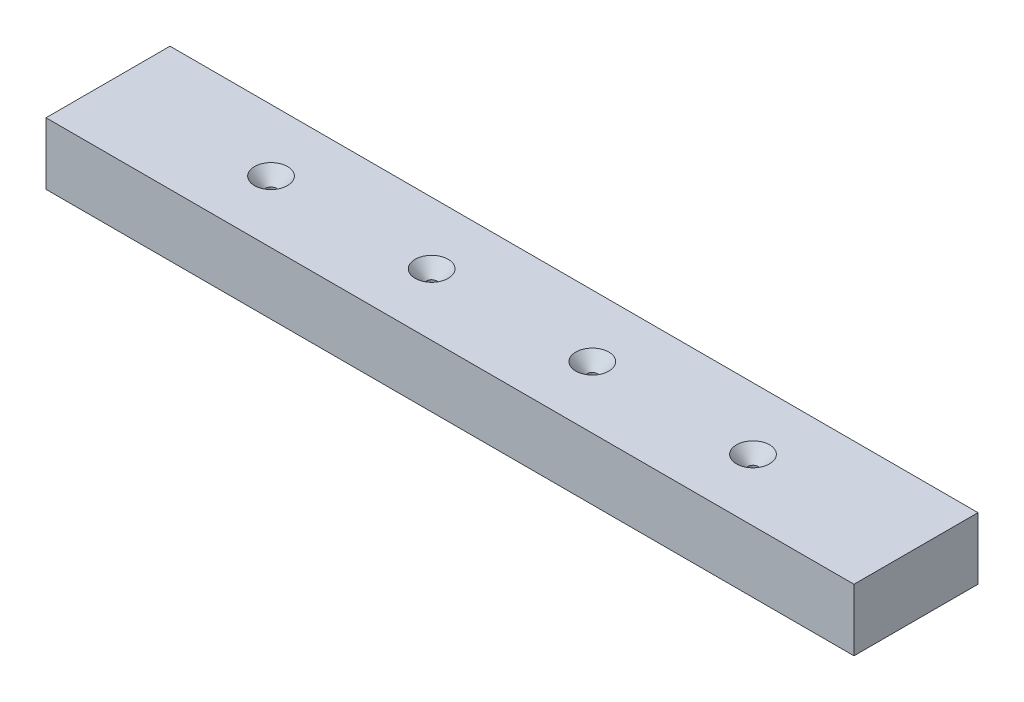
ISO-10303-21;
HEADER;
FILE_DESCRIPTION(('STEP AP214'),'2;1');
FILE_NAME('part.step','',(''),(''),'','','');
FILE_SCHEMA(('AUTOMOTIVE_DESIGN { 1 0 10303 214 1 1 1 1 }'));
ENDSEC;
DATA;
#1=APPLICATION_CONTEXT('core data for automotive mechanical design processes');
#2=APPLICATION_PROTOCOL_DEFINITION('international standard','automotive_design',2000,#1);
#3=PRODUCT_CONTEXT('',#1,'mechanical');
#4=PRODUCT('Part','Part','',(#3));
#5=PRODUCT_RELATED_PRODUCT_CATEGORY('part','',(#4));
#6=PRODUCT_DEFINITION_FORMATION('','',#4);
#7=PRODUCT_DEFINITION_CONTEXT('part definition',#1,'design');
#8=PRODUCT_DEFINITION('design','',#6,#7);
#9=PRODUCT_DEFINITION_SHAPE('','',#8);
#10=(LENGTH_UNIT() NAMED_UNIT(*) SI_UNIT(.MILLI.,.METRE.));
#11=(NAMED_UNIT(*) PLANE_ANGLE_UNIT() SI_UNIT($,.RADIAN.));
#12=(NAMED_UNIT(*) SI_UNIT($,.STERADIAN.) SOLID_ANGLE_UNIT());
#13=UNCERTAINTY_MEASURE_WITH_UNIT(LENGTH_MEASURE(1.E-05),#10,'distance_accuracy_value','');
#14=(GEOMETRIC_REPRESENTATION_CONTEXT(3) GLOBAL_UNCERTAINTY_ASSIGNED_CONTEXT((#13)) GLOBAL_UNIT_ASSIGNED_CONTEXT((#10,
#11,#12)) REPRESENTATION_CONTEXT('',''));
#15=CARTESIAN_POINT('',(0.,0.,0.));
#16=DIRECTION('',(0.,0.,1.));
#17=DIRECTION('',(1.,0.,0.));
#18=AXIS2_PLACEMENT_3D('',#15,#16,#17);
#19=CARTESIAN_POINT('',(248.249999999993,38.1000000000005,38.0999999999995));
#20=DIRECTION('',(-1.,0.,0.));
#21=DIRECTION('',(0.,-1.,0.));
#22=AXIS2_PLACEMENT_3D('',#19,#20,#21);
#23=PLANE('',#22);
#24=DIRECTION('',(0.,1.,0.));
#25=VECTOR('',#24,1.);
#26=CARTESIAN_POINT('',(248.249999999993,38.1000000000005,-2.22044604925031E-13));
#27=LINE('',#26,#25);
#28=CARTESIAN_POINT('',(248.249999999993,38.1000000000005,-2.22044604925031E-13));
#29=VERTEX_POINT('',#28);
#30=CARTESIAN_POINT('',(248.249999999993,57.1500000000001,-2.77555756156289E-13));
#31=VERTEX_POINT('',#30);
#32=EDGE_CURVE('E130',#29,#31,#27,.T.);
#33=ORIENTED_EDGE('',*,*,#32,.T.);
#34=DIRECTION('',(0.,0.,-0.999999999999999));
#35=VECTOR('',#34,1.);
#36=CARTESIAN_POINT('',(248.249999999993,57.15,38.0999999999989));
#37=LINE('',#36,#35);
#38=CARTESIAN_POINT('',(248.249999999993,57.15,38.0999999999989));
#39=VERTEX_POINT('',#38);
#40=EDGE_CURVE('E11',#39,#31,#37,.T.);
#41=ORIENTED_EDGE('',*,*,#40,.F.);
#42=DIRECTION('',(0.,1.,0.));
#43=VECTOR('',#42,1.);
#44=CARTESIAN_POINT('',(248.249999999993,38.1000000000005,38.0999999999995));
#45=LINE('',#44,#43);
#46=CARTESIAN_POINT('',(248.249999999993,38.1000000000005,38.0999999999995));
#47=VERTEX_POINT('',#46);
#48=EDGE_CURVE('E123',#47,#39,#45,.T.);
#49=ORIENTED_EDGE('',*,*,#48,.F.);
#50=DIRECTION('',(0.,0.,-0.999999999999999));
#51=VECTOR('',#50,1.);
#52=CARTESIAN_POINT('',(248.249999999993,38.1000000000005,38.0999999999995));
#53=LINE('',#52,#51);
#54=EDGE_CURVE('E129',#47,#29,#53,.T.);
#55=ORIENTED_EDGE('',*,*,#54,.T.);
#56=EDGE_LOOP('',(#33,#41,#49,#55));
#57=FACE_BOUND('',#56,.T.);
#58=ADVANCED_FACE('F35',(#57),#23,.F.);
#59=CARTESIAN_POINT('',(248.249999999993,57.15,38.0999999999989));
#60=DIRECTION('',(0.,-1.,0.));
#61=DIRECTION('',(1.,0.,0.));
#62=AXIS2_PLACEMENT_3D('',#59,#60,#61);
#63=PLANE('',#62);
#64=CARTESIAN_POINT('',(198.168749999995,57.1500000000041,19.0499999999458));
#65=DIRECTION('',(0.,1.,0.));
#66=DIRECTION('',(0.,0.,0.999999999999999));
#67=AXIS2_PLACEMENT_3D('',#64,#65,#66);
#68=CIRCLE('',#67,5.08);
#69=CARTESIAN_POINT('',(198.168749999995,57.1500000000041,24.1299999999458));
#70=VERTEX_POINT('',#69);
#71=EDGE_CURVE('E327',#70,#70,#68,.T.);
#72=ORIENTED_EDGE('',*,*,#71,.F.);
#73=EDGE_LOOP('',(#72));
#74=FACE_BOUND('',#73,.T.);
#75=CARTESIAN_POINT('',(148.806249999996,57.150000000004,19.0499999999588));
#76=DIRECTION('',(0.,1.,0.));
#77=DIRECTION('',(0.,0.,0.999999999999999));
#78=AXIS2_PLACEMENT_3D('',#75,#76,#77);
#79=CIRCLE('',#78,5.08);
#80=CARTESIAN_POINT('',(148.806249999996,57.150000000004,24.1299999999588));
#81=VERTEX_POINT('',#80);
#82=EDGE_CURVE('E158',#81,#81,#79,.T.);
#83=ORIENTED_EDGE('',*,*,#82,.F.);
#84=EDGE_LOOP('',(#83));
#85=FACE_BOUND('',#84,.T.);
#86=CARTESIAN_POINT('',(50.0812499999983,57.1500000000043,19.0499999999982));
#87=DIRECTION('',(0.,1.,0.));
#88=DIRECTION('',(0.,0.,0.999999999999999));
#89=AXIS2_PLACEMENT_3D('',#86,#87,#88);
#90=CIRCLE('',#89,5.08);
#91=CARTESIAN_POINT('',(50.0812499999983,57.1500000000043,24.1299999999982));
#92=VERTEX_POINT('',#91);
#93=EDGE_CURVE('E151',#92,#92,#90,.T.);
#94=ORIENTED_EDGE('',*,*,#93,.F.);
#95=EDGE_LOOP('',(#94));
#96=FACE_BOUND('',#95,.T.);
#97=CARTESIAN_POINT('',(99.4437499999972,57.1500000000041,19.0499999999765));
#98=DIRECTION('',(0.,1.,0.));
#99=DIRECTION('',(0.,0.,0.999999999999999));
#100=AXIS2_PLACEMENT_3D('',#97,#98,#99);
#101=CIRCLE('',#100,5.08);
#102=CARTESIAN_POINT('',(99.4437499999972,57.1500000000041,24.1299999999765));
#103=VERTEX_POINT('',#102);
#104=EDGE_CURVE('E147',#103,#103,#101,.T.);
#105=ORIENTED_EDGE('',*,*,#104,.F.);
#106=EDGE_LOOP('',(#105));
#107=FACE_BOUND('',#106,.T.);
#108=DIRECTION('',(-1.,0.,0.));
#109=VECTOR('',#108,1.);
#110=CARTESIAN_POINT('',(248.249999999993,57.1500000000001,-2.77555756156289E-13));
#111=LINE('',#110,#109);
#112=CARTESIAN_POINT('',(-2.88657986402541E-12,57.1500000000001,-4.44089209850063E-13));
#113=VERTEX_POINT('',#112);
#114=EDGE_CURVE('E133',#31,#113,#111,.T.);
#115=ORIENTED_EDGE('',*,*,#114,.T.);
#116=DIRECTION('',(0.,0.,-0.999999999999999));
#117=VECTOR('',#116,1.);
#118=CARTESIAN_POINT('',(-2.88657986402541E-12,57.1499999999998,38.0999999999989));
#119=LINE('',#118,#117);
#120=CARTESIAN_POINT('',(-2.88657986402541E-12,57.1499999999998,38.0999999999989));
#121=VERTEX_POINT('',#120);
#122=EDGE_CURVE('E44',#121,#113,#119,.T.);
#123=ORIENTED_EDGE('',*,*,#122,.F.);
#124=DIRECTION('',(-1.,0.,0.));
#125=VECTOR('',#124,1.);
#126=CARTESIAN_POINT('',(248.249999999993,57.15,38.0999999999989));
#127=LINE('',#126,#125);
#128=EDGE_CURVE('E84',#39,#121,#127,.T.);
#129=ORIENTED_EDGE('',*,*,#128,.F.);
#130=ORIENTED_EDGE('',*,*,#40,.T.);
#131=EDGE_LOOP('',(#115,#123,#129,#130));
#132=FACE_BOUND('',#131,.T.);
#133=ADVANCED_FACE('F188',(#74,#85,#96,#107,#132),#63,.F.);
#134=CARTESIAN_POINT('',(-2.66453525910038E-12,38.1000000000003,38.0999999999998));
#135=DIRECTION('',(1.,0.,0.));
#136=DIRECTION('',(0.,1.,0.));
#137=AXIS2_PLACEMENT_3D('',#134,#135,#136);
#138=PLANE('',#137);
#139=DIRECTION('',(0.,-1.,0.));
#140=VECTOR('',#139,1.);
#141=CARTESIAN_POINT('',(-2.66453525910038E-12,38.1000000000006,0.));
#142=LINE('',#141,#140);
#143=CARTESIAN_POINT('',(-2.66453525910038E-12,38.1000000000006,0.));
#144=VERTEX_POINT('',#143);
#145=EDGE_CURVE('E71',#113,#144,#142,.T.);
#146=ORIENTED_EDGE('',*,*,#145,.T.);
#147=DIRECTION('',(0.,0.,-0.999999999999999));
#148=VECTOR('',#147,1.);
#149=CARTESIAN_POINT('',(-2.66453525910038E-12,38.1000000000003,38.0999999999998));
#150=LINE('',#149,#148);
#151=CARTESIAN_POINT('',(-2.66453525910038E-12,38.1000000000003,38.0999999999998));
#152=VERTEX_POINT('',#151);
#153=EDGE_CURVE('E138',#152,#144,#150,.T.);
#154=ORIENTED_EDGE('',*,*,#153,.F.);
#155=DIRECTION('',(0.,-1.,0.));
#156=VECTOR('',#155,1.);
#157=CARTESIAN_POINT('',(-2.66453525910038E-12,38.1000000000003,38.0999999999998));
#158=LINE('',#157,#156);
#159=EDGE_CURVE('E126',#121,#152,#158,.T.);
#160=ORIENTED_EDGE('',*,*,#159,.F.);
#161=ORIENTED_EDGE('',*,*,#122,.T.);
#162=EDGE_LOOP('',(#146,#154,#160,#161));
#163=FACE_BOUND('',#162,.T.);
#164=ADVANCED_FACE('F193',(#163),#138,.F.);
#165=CARTESIAN_POINT('',(248.249999999993,38.1000000000005,38.0999999999995));
#166=DIRECTION('',(0.,1.,0.));
#167=DIRECTION('',(0.,0.,0.999999999999999));
#168=AXIS2_PLACEMENT_3D('',#165,#166,#167);
#169=PLANE('',#168);
#170=CARTESIAN_POINT('',(198.168749999995,38.1000000000006,19.0499999999458));
#171=DIRECTION('',(0.,1.,0.));
#172=DIRECTION('',(0.,0.,0.999999999999999));
#173=AXIS2_PLACEMENT_3D('',#170,#171,#172);
#174=CIRCLE('',#173,1.58749999999999);
#175=CARTESIAN_POINT('',(198.168749999995,38.1000000000006,20.6374999999458));
#176=VERTEX_POINT('',#175);
#177=EDGE_CURVE('E38',#176,#176,#174,.T.);
#178=ORIENTED_EDGE('',*,*,#177,.T.);
#179=EDGE_LOOP('',(#178));
#180=FACE_BOUND('',#179,.T.);
#181=CARTESIAN_POINT('',(148.806249999996,38.1000000000005,19.0499999999589));
#182=DIRECTION('',(0.,1.,0.));
#183=DIRECTION('',(0.,0.,0.999999999999999));
#184=AXIS2_PLACEMENT_3D('',#181,#182,#183);
#185=CIRCLE('',#184,1.58749999999999);
#186=CARTESIAN_POINT('',(148.806249999996,38.1000000000005,20.6374999999589));
#187=VERTEX_POINT('',#186);
#188=EDGE_CURVE('E149',#187,#187,#185,.T.);
#189=ORIENTED_EDGE('',*,*,#188,.T.);
#190=EDGE_LOOP('',(#189));
#191=FACE_BOUND('',#190,.T.);
#192=CARTESIAN_POINT('',(50.0812499999983,38.1000000000007,19.0499999999986));
#193=DIRECTION('',(0.,1.,0.));
#194=DIRECTION('',(0.,0.,0.999999999999999));
#195=AXIS2_PLACEMENT_3D('',#192,#193,#194);
#196=CIRCLE('',#195,1.5875);
#197=CARTESIAN_POINT('',(50.0812499999983,38.1000000000007,20.6374999999986));
#198=VERTEX_POINT('',#197);
#199=EDGE_CURVE('E145',#198,#198,#196,.T.);
#200=ORIENTED_EDGE('',*,*,#199,.T.);
#201=EDGE_LOOP('',(#200));
#202=FACE_BOUND('',#201,.T.);
#203=CARTESIAN_POINT('',(99.4437499999969,38.1000000000005,19.0499999999766));
#204=DIRECTION('',(0.,1.,0.));
#205=DIRECTION('',(0.,0.,0.999999999999999));
#206=AXIS2_PLACEMENT_3D('',#203,#204,#205);
#207=CIRCLE('',#206,1.58750000000001);
#208=CARTESIAN_POINT('',(99.4437499999969,38.1000000000005,20.6374999999766));
#209=VERTEX_POINT('',#208);
#210=EDGE_CURVE('E105',#209,#209,#207,.T.);
#211=ORIENTED_EDGE('',*,*,#210,.T.);
#212=EDGE_LOOP('',(#211));
#213=FACE_BOUND('',#212,.T.);
#214=DIRECTION('',(1.,0.,0.));
#215=VECTOR('',#214,1.);
#216=CARTESIAN_POINT('',(248.249999999993,38.1000000000005,-2.22044604925031E-13));
#217=LINE('',#216,#215);
#218=EDGE_CURVE('E77',#144,#29,#217,.T.);
#219=ORIENTED_EDGE('',*,*,#218,.T.);
#220=ORIENTED_EDGE('',*,*,#54,.F.);
#221=DIRECTION('',(1.,0.,0.));
#222=VECTOR('',#221,1.);
#223=CARTESIAN_POINT('',(248.249999999993,38.1000000000005,38.0999999999995));
#224=LINE('',#223,#222);
#225=EDGE_CURVE('E53',#152,#47,#224,.T.);
#226=ORIENTED_EDGE('',*,*,#225,.F.);
#227=ORIENTED_EDGE('',*,*,#153,.T.);
#228=EDGE_LOOP('',(#219,#220,#226,#227));
#229=FACE_BOUND('',#228,.T.);
#230=ADVANCED_FACE('F203',(#180,#191,#202,#213,#229),#169,.F.);
#231=CARTESIAN_POINT('',(-2.22044604925031E-13,0.,38.0999999999993));
#232=DIRECTION('',(0.,0.,0.999999999999999));
#233=DIRECTION('',(1.,0.,0.));
#234=AXIS2_PLACEMENT_3D('',#231,#232,#233);
#235=PLANE('',#234);
#236=ORIENTED_EDGE('',*,*,#48,.T.);
#237=ORIENTED_EDGE('',*,*,#128,.T.);
#238=ORIENTED_EDGE('',*,*,#159,.T.);
#239=ORIENTED_EDGE('',*,*,#225,.T.);
#240=EDGE_LOOP('',(#236,#237,#238,#239));
#241=FACE_BOUND('',#240,.T.);
#242=ADVANCED_FACE('F201',(#241),#235,.T.);
#243=CARTESIAN_POINT('',(0.,0.,0.));
#244=DIRECTION('',(0.,0.,0.999999999999999));
#245=DIRECTION('',(1.,0.,0.));
#246=AXIS2_PLACEMENT_3D('',#243,#244,#245);
#247=PLANE('',#246);
#248=CARTESIAN_POINT('',(222.849999999992,47.6249999999993,0.));
#249=DIRECTION('',(0.,0.,0.999999999999999));
#250=DIRECTION('',(1.,0.,0.));
#251=AXIS2_PLACEMENT_3D('',#248,#249,#250);
#252=CIRCLE('',#251,1.58749999999999);
#253=CARTESIAN_POINT('',(224.437499999992,47.6249999999993,0.));
#254=VERTEX_POINT('',#253);
#255=EDGE_CURVE('E104',#254,#254,#252,.T.);
#256=ORIENTED_EDGE('',*,*,#255,.T.);
#257=EDGE_LOOP('',(#256));
#258=FACE_BOUND('',#257,.T.);
#259=CARTESIAN_POINT('',(25.3999999999957,47.6249999999994,-2.22044604925031E-13));
#260=DIRECTION('',(0.,0.,0.999999999999999));
#261=DIRECTION('',(1.,0.,0.));
#262=AXIS2_PLACEMENT_3D('',#259,#260,#261);
#263=CIRCLE('',#262,1.5875);
#264=CARTESIAN_POINT('',(26.9874999999956,47.6249999999994,-2.22132728877611E-13));
#265=VERTEX_POINT('',#264);
#266=EDGE_CURVE('E118',#265,#265,#263,.T.);
#267=ORIENTED_EDGE('',*,*,#266,.T.);
#268=EDGE_LOOP('',(#267));
#269=FACE_BOUND('',#268,.T.);
#270=CARTESIAN_POINT('',(124.124999999994,47.6249999999993,-6.10622663543836E-13));
#271=DIRECTION('',(0.,0.,0.999999999999999));
#272=DIRECTION('',(1.,0.,0.));
#273=AXIS2_PLACEMENT_3D('',#270,#271,#272);
#274=CIRCLE('',#273,1.58749999999999);
#275=CARTESIAN_POINT('',(125.712499999994,47.6249999999993,-6.10710787496416E-13));
#276=VERTEX_POINT('',#275);
#277=EDGE_CURVE('E122',#276,#276,#274,.T.);
#278=ORIENTED_EDGE('',*,*,#277,.T.);
#279=EDGE_LOOP('',(#278));
#280=FACE_BOUND('',#279,.T.);
#281=ORIENTED_EDGE('',*,*,#32,.F.);
#282=ORIENTED_EDGE('',*,*,#218,.F.);
#283=ORIENTED_EDGE('',*,*,#145,.F.);
#284=ORIENTED_EDGE('',*,*,#114,.F.);
#285=EDGE_LOOP('',(#281,#282,#283,#284));
#286=FACE_BOUND('',#285,.T.);
#287=ADVANCED_FACE('F199',(#258,#269,#280,#286),#247,.F.);
#288=CARTESIAN_POINT('',(124.124999999994,47.6249999999994,-12.6999999999973));
#289=DIRECTION('',(0.,0.,-0.999999999999999));
#290=DIRECTION('',(0.,1.,0.));
#291=AXIS2_PLACEMENT_3D('',#288,#289,#290);
#292=CYLINDRICAL_SURFACE('',#291,1.58749999999999);
#293=CARTESIAN_POINT('',(124.124999999994,47.6249999999993,19.0500000000028));
#294=DIRECTION('',(0.,0.,-0.999999999999999));
#295=DIRECTION('',(0.,1.,0.));
#296=AXIS2_PLACEMENT_3D('',#293,#294,#295);
#297=CIRCLE('',#296,1.58749999999999);
#298=CARTESIAN_POINT('',(124.124999999994,49.2124999999993,19.0500000000028));
#299=VERTEX_POINT('',#298);
#300=EDGE_CURVE('E119',#299,#299,#297,.T.);
#301=ORIENTED_EDGE('',*,*,#300,.F.);
#302=EDGE_LOOP('',(#301));
#303=FACE_BOUND('',#302,.T.);
#304=ORIENTED_EDGE('',*,*,#277,.F.);
#305=EDGE_LOOP('',(#304));
#306=FACE_BOUND('',#305,.T.);
#307=ADVANCED_FACE('F209',(#303,#306),#292,.F.);
#308=CARTESIAN_POINT('',(124.124999999994,47.6249999999993,19.0500000000028));
#309=DIRECTION('',(0.,0.,-0.999999999999999));
#310=DIRECTION('',(0.,1.,0.));
#311=AXIS2_PLACEMENT_3D('',#308,#309,#310);
#312=CONICAL_SURFACE('',#311,1.58749999999999,1.02974425867665);
#313=CARTESIAN_POINT('',(124.124999999994,47.6249999999993,20.0038662327096));
#314=VERTEX_POINT('',#313);
#315=VERTEX_LOOP('',#314);
#316=FACE_BOUND('',#315,.T.);
#317=ORIENTED_EDGE('',*,*,#300,.T.);
#318=EDGE_LOOP('',(#317));
#319=FACE_BOUND('',#318,.T.);
#320=ADVANCED_FACE('F215',(#316,#319),#312,.F.);
#321=CARTESIAN_POINT('',(25.3999999999961,47.6249999999993,-12.699999999998));
#322=DIRECTION('',(0.,0.,-0.999999999999999));
#323=DIRECTION('',(0.,1.,0.));
#324=AXIS2_PLACEMENT_3D('',#321,#322,#323);
#325=CYLINDRICAL_SURFACE('',#324,1.5875);
#326=CARTESIAN_POINT('',(25.3999999999957,47.6249999999993,19.0500000000029));
#327=DIRECTION('',(0.,0.,-0.999999999999999));
#328=DIRECTION('',(0.,1.,0.));
#329=AXIS2_PLACEMENT_3D('',#326,#327,#328);
#330=CIRCLE('',#329,1.5875);
#331=CARTESIAN_POINT('',(25.3999999999957,49.2124999999993,19.0500000000029));
#332=VERTEX_POINT('',#331);
#333=EDGE_CURVE('E108',#332,#332,#330,.T.);
#334=ORIENTED_EDGE('',*,*,#333,.F.);
#335=EDGE_LOOP('',(#334));
#336=FACE_BOUND('',#335,.T.);
#337=ORIENTED_EDGE('',*,*,#266,.F.);
#338=EDGE_LOOP('',(#337));
#339=FACE_BOUND('',#338,.T.);
#340=ADVANCED_FACE('F246',(#336,#339),#325,.F.);
#341=CARTESIAN_POINT('',(25.3999999999957,47.6249999999993,19.0500000000029));
#342=DIRECTION('',(0.,0.,-0.999999999999999));
#343=DIRECTION('',(0.,1.,0.));
#344=AXIS2_PLACEMENT_3D('',#341,#342,#343);
#345=CONICAL_SURFACE('',#344,1.5875,1.02974425867666);
#346=CARTESIAN_POINT('',(25.3999999999957,47.6249999999993,20.0038662327086));
#347=VERTEX_POINT('',#346);
#348=VERTEX_LOOP('',#347);
#349=FACE_BOUND('',#348,.T.);
#350=ORIENTED_EDGE('',*,*,#333,.T.);
#351=EDGE_LOOP('',(#350));
#352=FACE_BOUND('',#351,.T.);
#353=ADVANCED_FACE('F253',(#349,#352),#345,.F.);
#354=CARTESIAN_POINT('',(222.849999999992,47.6249999999996,-12.6999999999958));
#355=DIRECTION('',(0.,0.,-0.999999999999999));
#356=DIRECTION('',(0.,1.,0.));
#357=AXIS2_PLACEMENT_3D('',#354,#355,#356);
#358=CYLINDRICAL_SURFACE('',#357,1.58749999999999);
#359=CARTESIAN_POINT('',(222.849999999992,47.6249999999993,19.0500000000042));
#360=DIRECTION('',(0.,0.,-0.999999999999999));
#361=DIRECTION('',(0.,1.,0.));
#362=AXIS2_PLACEMENT_3D('',#359,#360,#361);
#363=CIRCLE('',#362,1.58749999999999);
#364=CARTESIAN_POINT('',(222.849999999992,49.2124999999993,19.0500000000042));
#365=VERTEX_POINT('',#364);
#366=EDGE_CURVE('E102',#365,#365,#363,.T.);
#367=ORIENTED_EDGE('',*,*,#366,.F.);
#368=EDGE_LOOP('',(#367));
#369=FACE_BOUND('',#368,.T.);
#370=ORIENTED_EDGE('',*,*,#255,.F.);
#371=EDGE_LOOP('',(#370));
#372=FACE_BOUND('',#371,.T.);
#373=ADVANCED_FACE('F98',(#369,#372),#358,.F.);
#374=CARTESIAN_POINT('',(222.849999999992,47.6249999999993,19.0500000000042));
#375=DIRECTION('',(0.,0.,-0.999999999999999));
#376=DIRECTION('',(0.,1.,0.));
#377=AXIS2_PLACEMENT_3D('',#374,#375,#376);
#378=CONICAL_SURFACE('',#377,1.58749999999999,1.02974425867665);
#379=CARTESIAN_POINT('',(222.849999999992,47.6249999999992,20.0038662327098));
#380=VERTEX_POINT('',#379);
#381=VERTEX_LOOP('',#380);
#382=FACE_BOUND('',#381,.T.);
#383=ORIENTED_EDGE('',*,*,#366,.T.);
#384=EDGE_LOOP('',(#383));
#385=FACE_BOUND('',#384,.T.);
#386=ADVANCED_FACE('F94',(#382,#385),#378,.F.);
#387=CARTESIAN_POINT('',(99.4437499999972,57.1500000000041,19.0499999999765));
#388=DIRECTION('',(0.,1.,0.));
#389=DIRECTION('',(0.,0.,0.999999999999999));
#390=AXIS2_PLACEMENT_3D('',#387,#388,#389);
#391=CYLINDRICAL_SURFACE('',#390,1.58750000000001);
#392=CARTESIAN_POINT('',(99.4437499999972,53.1323383377847,19.0499999999765));
#393=DIRECTION('',(0.,1.,0.));
#394=DIRECTION('',(0.,0.,0.999999999999999));
#395=AXIS2_PLACEMENT_3D('',#392,#393,#394);
#396=CIRCLE('',#395,1.58750000000001);
#397=CARTESIAN_POINT('',(99.4437499999972,53.1323383377847,20.6374999999765));
#398=VERTEX_POINT('',#397);
#399=EDGE_CURVE('E111',#398,#398,#396,.T.);
#400=ORIENTED_EDGE('',*,*,#399,.T.);
#401=EDGE_LOOP('',(#400));
#402=FACE_BOUND('',#401,.T.);
#403=ORIENTED_EDGE('',*,*,#210,.F.);
#404=EDGE_LOOP('',(#403));
#405=FACE_BOUND('',#404,.T.);
#406=ADVANCED_FACE('F97',(#402,#405),#391,.F.);
#407=CARTESIAN_POINT('',(99.4437499999972,57.1500000000041,19.0499999999765));
#408=DIRECTION('',(0.,1.,0.));
#409=DIRECTION('',(0.,0.,0.999999999999999));
#410=AXIS2_PLACEMENT_3D('',#407,#408,#409);
#411=CONICAL_SURFACE('',#410,5.08,0.715584993317676);
#412=ORIENTED_EDGE('',*,*,#399,.F.);
#413=EDGE_LOOP('',(#412));
#414=FACE_BOUND('',#413,.T.);
#415=ORIENTED_EDGE('',*,*,#104,.T.);
#416=EDGE_LOOP('',(#415));
#417=FACE_BOUND('',#416,.T.);
#418=ADVANCED_FACE('F175',(#414,#417),#411,.F.);
#419=CARTESIAN_POINT('',(50.0812499999983,57.1500000000043,19.0499999999982));
#420=DIRECTION('',(0.,1.,0.));
#421=DIRECTION('',(0.,0.,0.999999999999999));
#422=AXIS2_PLACEMENT_3D('',#419,#420,#421);
#423=CYLINDRICAL_SURFACE('',#422,1.5875);
#424=CARTESIAN_POINT('',(50.0812499999983,53.1323383377849,19.0499999999983));
#425=DIRECTION('',(0.,1.,0.));
#426=DIRECTION('',(0.,0.,0.999999999999999));
#427=AXIS2_PLACEMENT_3D('',#424,#425,#426);
#428=CIRCLE('',#427,1.58750000000001);
#429=CARTESIAN_POINT('',(50.0812499999983,53.1323383377849,20.6374999999983));
#430=VERTEX_POINT('',#429);
#431=EDGE_CURVE('E148',#430,#430,#428,.T.);
#432=ORIENTED_EDGE('',*,*,#431,.T.);
#433=EDGE_LOOP('',(#432));
#434=FACE_BOUND('',#433,.T.);
#435=ORIENTED_EDGE('',*,*,#199,.F.);
#436=EDGE_LOOP('',(#435));
#437=FACE_BOUND('',#436,.T.);
#438=ADVANCED_FACE('F177',(#434,#437),#423,.F.);
#439=CARTESIAN_POINT('',(50.0812499999983,57.1500000000043,19.0499999999982));
#440=DIRECTION('',(0.,1.,0.));
#441=DIRECTION('',(0.,0.,0.999999999999999));
#442=AXIS2_PLACEMENT_3D('',#439,#440,#441);
#443=CONICAL_SURFACE('',#442,5.08,0.715584993317676);
#444=ORIENTED_EDGE('',*,*,#431,.F.);
#445=EDGE_LOOP('',(#444));
#446=FACE_BOUND('',#445,.T.);
#447=ORIENTED_EDGE('',*,*,#93,.T.);
#448=EDGE_LOOP('',(#447));
#449=FACE_BOUND('',#448,.T.);
#450=ADVANCED_FACE('F183',(#446,#449),#443,.F.);
#451=CARTESIAN_POINT('',(148.806249999996,57.150000000004,19.0499999999588));
#452=DIRECTION('',(0.,1.,0.));
#453=DIRECTION('',(0.,0.,0.999999999999999));
#454=AXIS2_PLACEMENT_3D('',#451,#452,#453);
#455=CYLINDRICAL_SURFACE('',#454,1.58749999999999);
#456=CARTESIAN_POINT('',(148.806249999996,53.1323383377846,19.0499999999588));
#457=DIRECTION('',(0.,1.,0.));
#458=DIRECTION('',(0.,0.,0.999999999999999));
#459=AXIS2_PLACEMENT_3D('',#456,#457,#458);
#460=CIRCLE('',#459,1.58749999999999);
#461=CARTESIAN_POINT('',(148.806249999996,53.1323383377846,20.6374999999588));
#462=VERTEX_POINT('',#461);
#463=EDGE_CURVE('E152',#462,#462,#460,.T.);
#464=ORIENTED_EDGE('',*,*,#463,.T.);
#465=EDGE_LOOP('',(#464));
#466=FACE_BOUND('',#465,.T.);
#467=ORIENTED_EDGE('',*,*,#188,.F.);
#468=EDGE_LOOP('',(#467));
#469=FACE_BOUND('',#468,.T.);
#470=ADVANCED_FACE('F288',(#466,#469),#455,.F.);
#471=CARTESIAN_POINT('',(148.806249999996,57.150000000004,19.0499999999588));
#472=DIRECTION('',(0.,1.,0.));
#473=DIRECTION('',(0.,0.,0.999999999999999));
#474=AXIS2_PLACEMENT_3D('',#471,#472,#473);
#475=CONICAL_SURFACE('',#474,5.08,0.715584993317678);
#476=ORIENTED_EDGE('',*,*,#463,.F.);
#477=EDGE_LOOP('',(#476));
#478=FACE_BOUND('',#477,.T.);
#479=ORIENTED_EDGE('',*,*,#82,.T.);
#480=EDGE_LOOP('',(#479));
#481=FACE_BOUND('',#480,.T.);
#482=ADVANCED_FACE('F296',(#478,#481),#475,.F.);
#483=CARTESIAN_POINT('',(198.168749999995,57.1500000000041,19.0499999999458));
#484=DIRECTION('',(0.,1.,0.));
#485=DIRECTION('',(0.,0.,0.999999999999999));
#486=AXIS2_PLACEMENT_3D('',#483,#484,#485);
#487=CYLINDRICAL_SURFACE('',#486,1.58749999999999);
#488=CARTESIAN_POINT('',(198.168749999995,53.1323383377847,19.0499999999458));
#489=DIRECTION('',(0.,1.,0.));
#490=DIRECTION('',(0.,0.,0.999999999999999));
#491=AXIS2_PLACEMENT_3D('',#488,#489,#490);
#492=CIRCLE('',#491,1.58749999999999);
#493=CARTESIAN_POINT('',(198.168749999995,53.1323383377847,20.6374999999458));
#494=VERTEX_POINT('',#493);
#495=EDGE_CURVE('E324',#494,#494,#492,.T.);
#496=ORIENTED_EDGE('',*,*,#495,.T.);
#497=EDGE_LOOP('',(#496));
#498=FACE_BOUND('',#497,.T.);
#499=ORIENTED_EDGE('',*,*,#177,.F.);
#500=EDGE_LOOP('',(#499));
#501=FACE_BOUND('',#500,.T.);
#502=ADVANCED_FACE('F303',(#498,#501),#487,.F.);
#503=CARTESIAN_POINT('',(198.168749999995,57.1500000000041,19.0499999999458));
#504=DIRECTION('',(0.,1.,0.));
#505=DIRECTION('',(0.,0.,0.999999999999999));
#506=AXIS2_PLACEMENT_3D('',#503,#504,#505);
#507=CONICAL_SURFACE('',#506,5.08,0.715584993317678);
#508=ORIENTED_EDGE('',*,*,#495,.F.);
#509=EDGE_LOOP('',(#508));
#510=FACE_BOUND('',#509,.T.);
#511=ORIENTED_EDGE('',*,*,#71,.T.);
#512=EDGE_LOOP('',(#511));
#513=FACE_BOUND('',#512,.T.);
#514=ADVANCED_FACE('F311',(#510,#513),#507,.F.);
#515=CLOSED_SHELL('',(#58,#133,#164,#230,#242,#287,#307,#320,#340,#353,#373,#386,#406,#418,#438,
#450,#470,#482,#502,#514));
#516=MANIFOLD_SOLID_BREP('B2',#515);
#517=ADVANCED_BREP_SHAPE_REPRESENTATION('',(#18,#516),#14);
#518=SHAPE_DEFINITION_REPRESENTATION(#9,#517);
ENDSEC;
END-ISO-10303-21;
